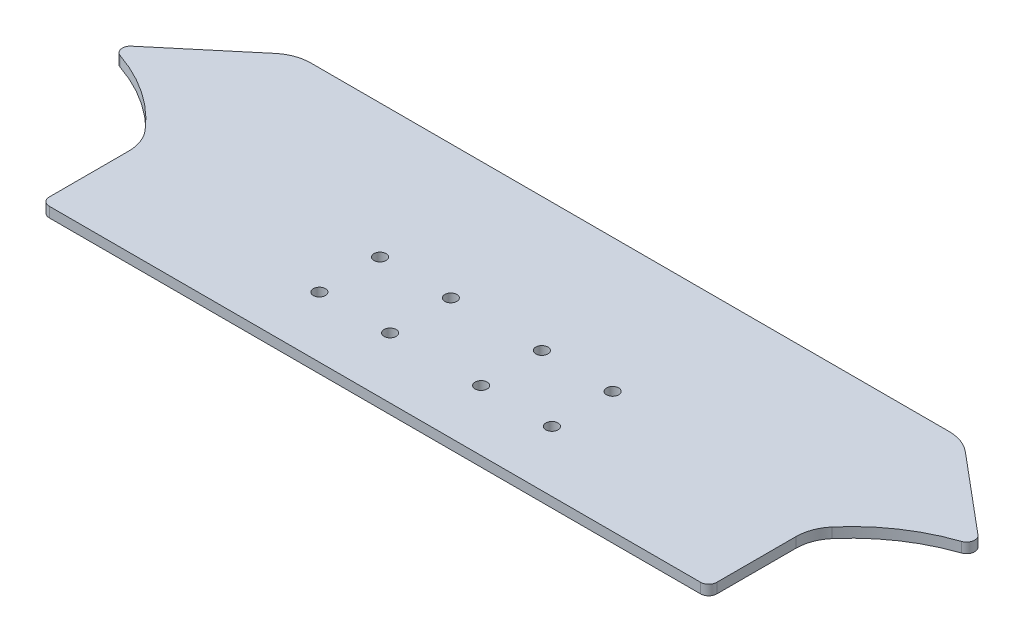
ISO-10303-21;
HEADER;
FILE_DESCRIPTION(('STEP AP214'),'2;1');
FILE_NAME('part.step','',(''),(''),'','','');
FILE_SCHEMA(('AUTOMOTIVE_DESIGN { 1 0 10303 214 1 1 1 1 }'));
ENDSEC;
DATA;
#1=APPLICATION_CONTEXT('core data for automotive mechanical design processes');
#2=APPLICATION_PROTOCOL_DEFINITION('international standard','automotive_design',2000,#1);
#3=PRODUCT_CONTEXT('',#1,'mechanical');
#4=PRODUCT('Part','Part','',(#3));
#5=PRODUCT_RELATED_PRODUCT_CATEGORY('part','',(#4));
#6=PRODUCT_DEFINITION_FORMATION('','',#4);
#7=PRODUCT_DEFINITION_CONTEXT('part definition',#1,'design');
#8=PRODUCT_DEFINITION('design','',#6,#7);
#9=PRODUCT_DEFINITION_SHAPE('','',#8);
#10=(LENGTH_UNIT() NAMED_UNIT(*) SI_UNIT(.MILLI.,.METRE.));
#11=(NAMED_UNIT(*) PLANE_ANGLE_UNIT() SI_UNIT($,.RADIAN.));
#12=(NAMED_UNIT(*) SI_UNIT($,.STERADIAN.) SOLID_ANGLE_UNIT());
#13=UNCERTAINTY_MEASURE_WITH_UNIT(LENGTH_MEASURE(1.E-05),#10,'distance_accuracy_value','');
#14=(GEOMETRIC_REPRESENTATION_CONTEXT(3) GLOBAL_UNCERTAINTY_ASSIGNED_CONTEXT((#13)) GLOBAL_UNIT_ASSIGNED_CONTEXT((#10,
#11,#12)) REPRESENTATION_CONTEXT('',''));
#15=CARTESIAN_POINT('',(0.,0.,0.));
#16=DIRECTION('',(0.,0.,1.));
#17=DIRECTION('',(1.,0.,0.));
#18=AXIS2_PLACEMENT_3D('',#15,#16,#17);
#19=CARTESIAN_POINT('',(-104.775,3.175,40.005));
#20=DIRECTION('',(1.,0.,0.));
#21=DIRECTION('',(0.,0.,-1.));
#22=AXIS2_PLACEMENT_3D('',#19,#20,#21);
#23=PLANE('',#22);
#24=DIRECTION('',(0.,0.,1.));
#25=VECTOR('',#24,1.);
#26=CARTESIAN_POINT('',(-104.775,0.,40.005));
#27=LINE('',#26,#25);
#28=CARTESIAN_POINT('',(-104.775,0.,12.591127239436));
#29=VERTEX_POINT('',#28);
#30=CARTESIAN_POINT('',(-104.775,0.,37.465));
#31=VERTEX_POINT('',#30);
#32=EDGE_CURVE('E264',#29,#31,#27,.T.);
#33=ORIENTED_EDGE('',*,*,#32,.T.);
#34=DIRECTION('',(0.,-1.,0.));
#35=VECTOR('',#34,1.);
#36=CARTESIAN_POINT('',(-104.775,3.175,37.465));
#37=LINE('',#36,#35);
#38=CARTESIAN_POINT('',(-104.775,3.175,37.465));
#39=VERTEX_POINT('',#38);
#40=EDGE_CURVE('E229',#31,#39,#37,.F.);
#41=ORIENTED_EDGE('',*,*,#40,.T.);
#42=DIRECTION('',(0.,0.,1.));
#43=VECTOR('',#42,1.);
#44=CARTESIAN_POINT('',(-104.775,3.175,40.005));
#45=LINE('',#44,#43);
#46=CARTESIAN_POINT('',(-104.775,3.175,12.591127239436));
#47=VERTEX_POINT('',#46);
#48=EDGE_CURVE('E183',#47,#39,#45,.T.);
#49=ORIENTED_EDGE('',*,*,#48,.F.);
#50=DIRECTION('',(0.,1.,0.));
#51=VECTOR('',#50,1.);
#52=CARTESIAN_POINT('',(-104.775,3.175,12.591127239436));
#53=LINE('',#52,#51);
#54=EDGE_CURVE('E170',#47,#29,#53,.F.);
#55=ORIENTED_EDGE('',*,*,#54,.T.);
#56=EDGE_LOOP('',(#33,#41,#49,#55));
#57=FACE_BOUND('',#56,.T.);
#58=ADVANCED_FACE('F36',(#57),#23,.F.);
#59=CARTESIAN_POINT('',(104.775,3.175,40.005));
#60=DIRECTION('',(-1.,0.,0.));
#61=DIRECTION('',(0.,0.,1.));
#62=AXIS2_PLACEMENT_3D('',#59,#60,#61);
#63=PLANE('',#62);
#64=DIRECTION('',(0.,0.,-1.));
#65=VECTOR('',#64,1.);
#66=CARTESIAN_POINT('',(104.775,3.175,40.005));
#67=LINE('',#66,#65);
#68=CARTESIAN_POINT('',(104.775,3.175,37.465));
#69=VERTEX_POINT('',#68);
#70=CARTESIAN_POINT('',(104.775,3.175,12.5911272394361));
#71=VERTEX_POINT('',#70);
#72=EDGE_CURVE('E273',#69,#71,#67,.T.);
#73=ORIENTED_EDGE('',*,*,#72,.F.);
#74=DIRECTION('',(0.,-1.,0.));
#75=VECTOR('',#74,1.);
#76=CARTESIAN_POINT('',(104.775,3.175,37.465));
#77=LINE('',#76,#75);
#78=CARTESIAN_POINT('',(104.775,0.,37.465));
#79=VERTEX_POINT('',#78);
#80=EDGE_CURVE('E231',#69,#79,#77,.T.);
#81=ORIENTED_EDGE('',*,*,#80,.T.);
#82=DIRECTION('',(0.,0.,-1.));
#83=VECTOR('',#82,1.);
#84=CARTESIAN_POINT('',(104.775,0.,40.005));
#85=LINE('',#84,#83);
#86=CARTESIAN_POINT('',(104.775,0.,12.5911272394361));
#87=VERTEX_POINT('',#86);
#88=EDGE_CURVE('E265',#79,#87,#85,.T.);
#89=ORIENTED_EDGE('',*,*,#88,.T.);
#90=DIRECTION('',(0.,1.,0.));
#91=VECTOR('',#90,1.);
#92=CARTESIAN_POINT('',(104.775,3.175,12.5911272394361));
#93=LINE('',#92,#91);
#94=EDGE_CURVE('E180',#87,#71,#93,.T.);
#95=ORIENTED_EDGE('',*,*,#94,.T.);
#96=EDGE_LOOP('',(#73,#81,#89,#95));
#97=FACE_BOUND('',#96,.T.);
#98=ADVANCED_FACE('F371',(#97),#63,.F.);
#99=CARTESIAN_POINT('',(-104.775,3.175,-40.005));
#100=DIRECTION('',(0.,0.,1.));
#101=DIRECTION('',(1.,0.,0.));
#102=AXIS2_PLACEMENT_3D('',#99,#100,#101);
#103=PLANE('',#102);
#104=DIRECTION('',(-1.,0.,0.));
#105=VECTOR('',#104,1.);
#106=CARTESIAN_POINT('',(-104.775,0.,-40.005));
#107=LINE('',#106,#105);
#108=CARTESIAN_POINT('',(100.152578024819,0.,-40.005));
#109=VERTEX_POINT('',#108);
#110=CARTESIAN_POINT('',(-100.152578024819,0.,-40.005));
#111=VERTEX_POINT('',#110);
#112=EDGE_CURVE('E261',#109,#111,#107,.T.);
#113=ORIENTED_EDGE('',*,*,#112,.T.);
#114=DIRECTION('',(0.,-1.,0.));
#115=VECTOR('',#114,1.);
#116=CARTESIAN_POINT('',(-100.152578024819,3.175,-40.005));
#117=LINE('',#116,#115);
#118=CARTESIAN_POINT('',(-100.152578024819,3.175,-40.005));
#119=VERTEX_POINT('',#118);
#120=EDGE_CURVE('E57',#111,#119,#117,.F.);
#121=ORIENTED_EDGE('',*,*,#120,.T.);
#122=DIRECTION('',(-1.,0.,0.));
#123=VECTOR('',#122,1.);
#124=CARTESIAN_POINT('',(-104.775,3.175,-40.005));
#125=LINE('',#124,#123);
#126=CARTESIAN_POINT('',(100.152578024819,3.175,-40.005));
#127=VERTEX_POINT('',#126);
#128=EDGE_CURVE('E248',#127,#119,#125,.T.);
#129=ORIENTED_EDGE('',*,*,#128,.F.);
#130=DIRECTION('',(0.,-1.,0.));
#131=VECTOR('',#130,1.);
#132=CARTESIAN_POINT('',(100.152578024819,0.,-40.005));
#133=LINE('',#132,#131);
#134=EDGE_CURVE('E241',#127,#109,#133,.T.);
#135=ORIENTED_EDGE('',*,*,#134,.T.);
#136=EDGE_LOOP('',(#113,#121,#129,#135));
#137=FACE_BOUND('',#136,.T.);
#138=ADVANCED_FACE('F262',(#137),#103,.F.);
#139=CARTESIAN_POINT('',(-104.775,3.175,40.005));
#140=DIRECTION('',(0.,0.,-1.));
#141=DIRECTION('',(-1.,0.,0.));
#142=AXIS2_PLACEMENT_3D('',#139,#140,#141);
#143=PLANE('',#142);
#144=DIRECTION('',(1.,0.,0.));
#145=VECTOR('',#144,1.);
#146=CARTESIAN_POINT('',(-104.775,3.175,40.005));
#147=LINE('',#146,#145);
#148=CARTESIAN_POINT('',(-102.235,3.175,40.005));
#149=VERTEX_POINT('',#148);
#150=CARTESIAN_POINT('',(102.235,3.175,40.005));
#151=VERTEX_POINT('',#150);
#152=EDGE_CURVE('E178',#149,#151,#147,.T.);
#153=ORIENTED_EDGE('',*,*,#152,.F.);
#154=DIRECTION('',(0.,-1.,0.));
#155=VECTOR('',#154,1.);
#156=CARTESIAN_POINT('',(-102.235,3.175,40.005));
#157=LINE('',#156,#155);
#158=CARTESIAN_POINT('',(-102.235,0.,40.005));
#159=VERTEX_POINT('',#158);
#160=EDGE_CURVE('E226',#149,#159,#157,.T.);
#161=ORIENTED_EDGE('',*,*,#160,.T.);
#162=DIRECTION('',(1.,0.,0.));
#163=VECTOR('',#162,1.);
#164=CARTESIAN_POINT('',(-104.775,0.,40.005));
#165=LINE('',#164,#163);
#166=CARTESIAN_POINT('',(102.235,0.,40.005));
#167=VERTEX_POINT('',#166);
#168=EDGE_CURVE('E186',#159,#167,#165,.T.);
#169=ORIENTED_EDGE('',*,*,#168,.T.);
#170=DIRECTION('',(0.,-1.,0.));
#171=VECTOR('',#170,1.);
#172=CARTESIAN_POINT('',(102.235,3.175,40.005));
#173=LINE('',#172,#171);
#174=EDGE_CURVE('E224',#167,#151,#173,.F.);
#175=ORIENTED_EDGE('',*,*,#174,.T.);
#176=EDGE_LOOP('',(#153,#161,#169,#175));
#177=FACE_BOUND('',#176,.T.);
#178=ADVANCED_FACE('F346',(#177),#143,.F.);
#179=CARTESIAN_POINT('',(0.,3.175,0.));
#180=DIRECTION('',(0.,-1.,0.));
#181=DIRECTION('',(0.,0.,-1.));
#182=AXIS2_PLACEMENT_3D('',#179,#180,#181);
#183=PLANE('',#182);
#184=CARTESIAN_POINT('',(36.5125,3.175,1.90499999999998));
#185=DIRECTION('',(0.,1.,0.));
#186=DIRECTION('',(0.,0.,1.));
#187=AXIS2_PLACEMENT_3D('',#184,#185,#186);
#188=CIRCLE('',#187,1.89865);
#189=CARTESIAN_POINT('',(36.5125,3.175,3.80364999999998));
#190=VERTEX_POINT('',#189);
#191=EDGE_CURVE('E304',#190,#190,#188,.T.);
#192=ORIENTED_EDGE('',*,*,#191,.F.);
#193=EDGE_LOOP('',(#192));
#194=FACE_BOUND('',#193,.T.);
#195=CARTESIAN_POINT('',(-36.5125,3.175,20.955));
#196=DIRECTION('',(0.,1.,0.));
#197=DIRECTION('',(0.,0.,1.));
#198=AXIS2_PLACEMENT_3D('',#195,#196,#197);
#199=CIRCLE('',#198,1.89865);
#200=CARTESIAN_POINT('',(-36.5125,3.175,22.85365));
#201=VERTEX_POINT('',#200);
#202=EDGE_CURVE('E311',#201,#201,#199,.T.);
#203=ORIENTED_EDGE('',*,*,#202,.F.);
#204=EDGE_LOOP('',(#203));
#205=FACE_BOUND('',#204,.T.);
#206=CARTESIAN_POINT('',(-14.2875,3.175,20.955));
#207=DIRECTION('',(0.,1.,0.));
#208=DIRECTION('',(0.,0.,1.));
#209=AXIS2_PLACEMENT_3D('',#206,#207,#208);
#210=CIRCLE('',#209,1.89865);
#211=CARTESIAN_POINT('',(-14.2875,3.175,22.85365));
#212=VERTEX_POINT('',#211);
#213=EDGE_CURVE('E292',#212,#212,#210,.T.);
#214=ORIENTED_EDGE('',*,*,#213,.F.);
#215=EDGE_LOOP('',(#214));
#216=FACE_BOUND('',#215,.T.);
#217=CARTESIAN_POINT('',(14.2875,3.175,20.955));
#218=DIRECTION('',(0.,1.,0.));
#219=DIRECTION('',(0.,0.,1.));
#220=AXIS2_PLACEMENT_3D('',#217,#218,#219);
#221=CIRCLE('',#220,1.89865);
#222=CARTESIAN_POINT('',(14.2875,3.175,22.85365));
#223=VERTEX_POINT('',#222);
#224=EDGE_CURVE('E299',#223,#223,#221,.T.);
#225=ORIENTED_EDGE('',*,*,#224,.F.);
#226=EDGE_LOOP('',(#225));
#227=FACE_BOUND('',#226,.T.);
#228=CARTESIAN_POINT('',(14.2875,3.175,1.90499999999999));
#229=DIRECTION('',(0.,1.,0.));
#230=DIRECTION('',(0.,0.,1.));
#231=AXIS2_PLACEMENT_3D('',#228,#229,#230);
#232=CIRCLE('',#231,1.89865);
#233=CARTESIAN_POINT('',(14.2875,3.175,3.80364999999999));
#234=VERTEX_POINT('',#233);
#235=EDGE_CURVE('E328',#234,#234,#232,.T.);
#236=ORIENTED_EDGE('',*,*,#235,.F.);
#237=EDGE_LOOP('',(#236));
#238=FACE_BOUND('',#237,.T.);
#239=CARTESIAN_POINT('',(-14.2875,3.175,1.90499999999999));
#240=DIRECTION('',(0.,1.,0.));
#241=DIRECTION('',(0.,0.,1.));
#242=AXIS2_PLACEMENT_3D('',#239,#240,#241);
#243=CIRCLE('',#242,1.89865);
#244=CARTESIAN_POINT('',(-14.2875,3.175,3.80364999999999));
#245=VERTEX_POINT('',#244);
#246=EDGE_CURVE('E322',#245,#245,#243,.T.);
#247=ORIENTED_EDGE('',*,*,#246,.F.);
#248=EDGE_LOOP('',(#247));
#249=FACE_BOUND('',#248,.T.);
#250=CARTESIAN_POINT('',(-36.5125,3.175,1.90499999999999));
#251=DIRECTION('',(0.,1.,0.));
#252=DIRECTION('',(0.,0.,1.));
#253=AXIS2_PLACEMENT_3D('',#250,#251,#252);
#254=CIRCLE('',#253,1.89865);
#255=CARTESIAN_POINT('',(-36.5125,3.175,3.80364999999999));
#256=VERTEX_POINT('',#255);
#257=EDGE_CURVE('E316',#256,#256,#254,.T.);
#258=ORIENTED_EDGE('',*,*,#257,.F.);
#259=EDGE_LOOP('',(#258));
#260=FACE_BOUND('',#259,.T.);
#261=CARTESIAN_POINT('',(36.5125,3.175,20.955));
#262=DIRECTION('',(0.,1.,0.));
#263=DIRECTION('',(0.,0.,1.));
#264=AXIS2_PLACEMENT_3D('',#261,#262,#263);
#265=CIRCLE('',#264,1.89865);
#266=CARTESIAN_POINT('',(36.5125,3.175,22.85365));
#267=VERTEX_POINT('',#266);
#268=EDGE_CURVE('E286',#267,#267,#265,.T.);
#269=ORIENTED_EDGE('',*,*,#268,.F.);
#270=EDGE_LOOP('',(#269));
#271=FACE_BOUND('',#270,.T.);
#272=ORIENTED_EDGE('',*,*,#128,.T.);
#273=CARTESIAN_POINT('',(-100.152578024819,3.175,-27.305));
#274=DIRECTION('',(0.,-1.,0.));
#275=DIRECTION('',(0.,0.,-1.));
#276=AXIS2_PLACEMENT_3D('',#273,#274,#275);
#277=CIRCLE('',#276,12.7);
#278=CARTESIAN_POINT('',(-108.315980667838,3.175,-37.0337644276111));
#279=VERTEX_POINT('',#278);
#280=EDGE_CURVE('E44',#119,#279,#277,.F.);
#281=ORIENTED_EDGE('',*,*,#280,.T.);
#282=DIRECTION('',(-0.766044443118982,0.,0.642787609686535));
#283=VECTOR('',#282,1.);
#284=CARTESIAN_POINT('',(-104.775,3.175,-40.005));
#285=LINE('',#284,#283);
#286=CARTESIAN_POINT('',(-132.884389834064,3.175,-16.4184213576186));
#287=VERTEX_POINT('',#286);
#288=EDGE_CURVE('E162',#279,#287,#285,.T.);
#289=ORIENTED_EDGE('',*,*,#288,.T.);
#290=CARTESIAN_POINT('',(-131.25170930546,3.175,-14.4726684720964));
#291=DIRECTION('',(0.,-1.,0.));
#292=DIRECTION('',(0.,0.,-1.));
#293=AXIS2_PLACEMENT_3D('',#290,#291,#292);
#294=CIRCLE('',#293,2.54);
#295=CARTESIAN_POINT('',(-132.063578843598,3.175,-12.0659138412618));
#296=VERTEX_POINT('',#295);
#297=EDGE_CURVE('E157',#287,#296,#294,.F.);
#298=ORIENTED_EDGE('',*,*,#297,.T.);
#299=CARTESIAN_POINT('',(-149.628638542296,3.175,40.005));
#300=DIRECTION('',(0.,-1.,0.));
#301=DIRECTION('',(0.,0.,1.));
#302=AXIS2_PLACEMENT_3D('',#299,#300,#301);
#303=CIRCLE('',#302,54.9537204425953);
#304=CARTESIAN_POINT('',(-107.810733629849,3.175,4.35146975099881));
#305=VERTEX_POINT('',#304);
#306=EDGE_CURVE('E150',#296,#305,#303,.T.);
#307=ORIENTED_EDGE('',*,*,#306,.T.);
#308=CARTESIAN_POINT('',(-117.475,3.175,12.591127239436));
#309=DIRECTION('',(0.,-1.,0.));
#310=DIRECTION('',(0.,0.,-1.));
#311=AXIS2_PLACEMENT_3D('',#308,#309,#310);
#312=CIRCLE('',#311,12.7);
#313=EDGE_CURVE('E154',#305,#47,#312,.T.);
#314=ORIENTED_EDGE('',*,*,#313,.T.);
#315=ORIENTED_EDGE('',*,*,#48,.T.);
#316=CARTESIAN_POINT('',(-102.235,3.175,37.465));
#317=DIRECTION('',(0.,-1.,0.));
#318=DIRECTION('',(0.,0.,-1.));
#319=AXIS2_PLACEMENT_3D('',#316,#317,#318);
#320=CIRCLE('',#319,2.54);
#321=EDGE_CURVE('E203',#39,#149,#320,.F.);
#322=ORIENTED_EDGE('',*,*,#321,.T.);
#323=ORIENTED_EDGE('',*,*,#152,.T.);
#324=CARTESIAN_POINT('',(102.235,3.175,37.465));
#325=DIRECTION('',(0.,-1.,0.));
#326=DIRECTION('',(0.,0.,-1.));
#327=AXIS2_PLACEMENT_3D('',#324,#325,#326);
#328=CIRCLE('',#327,2.54);
#329=EDGE_CURVE('E201',#151,#69,#328,.F.);
#330=ORIENTED_EDGE('',*,*,#329,.T.);
#331=ORIENTED_EDGE('',*,*,#72,.T.);
#332=CARTESIAN_POINT('',(117.475,3.175,12.5911272394361));
#333=DIRECTION('',(0.,-1.,0.));
#334=DIRECTION('',(0.,0.,-1.));
#335=AXIS2_PLACEMENT_3D('',#332,#333,#334);
#336=CIRCLE('',#335,12.7);
#337=CARTESIAN_POINT('',(107.810733629849,3.175,4.35146975099884));
#338=VERTEX_POINT('',#337);
#339=EDGE_CURVE('E193',#71,#338,#336,.T.);
#340=ORIENTED_EDGE('',*,*,#339,.T.);
#341=CARTESIAN_POINT('',(149.628638542296,3.175,40.005));
#342=DIRECTION('',(0.,-1.,0.));
#343=DIRECTION('',(0.,0.,1.));
#344=AXIS2_PLACEMENT_3D('',#341,#342,#343);
#345=CIRCLE('',#344,54.9537204425952);
#346=CARTESIAN_POINT('',(132.063578843598,3.175,-12.0659138412618));
#347=VERTEX_POINT('',#346);
#348=EDGE_CURVE('E278',#338,#347,#345,.T.);
#349=ORIENTED_EDGE('',*,*,#348,.T.);
#350=CARTESIAN_POINT('',(131.25170930546,3.175,-14.4726684720964));
#351=DIRECTION('',(0.,-1.,0.));
#352=DIRECTION('',(0.,0.,-1.));
#353=AXIS2_PLACEMENT_3D('',#350,#351,#352);
#354=CIRCLE('',#353,2.54);
#355=CARTESIAN_POINT('',(132.884389834064,3.175,-16.4184213576186));
#356=VERTEX_POINT('',#355);
#357=EDGE_CURVE('E205',#347,#356,#354,.F.);
#358=ORIENTED_EDGE('',*,*,#357,.T.);
#359=DIRECTION('',(-0.766044443118982,0.,-0.642787609686535));
#360=VECTOR('',#359,1.);
#361=CARTESIAN_POINT('',(104.775,3.175,-40.005));
#362=LINE('',#361,#360);
#363=CARTESIAN_POINT('',(108.315980667838,3.175,-37.0337644276111));
#364=VERTEX_POINT('',#363);
#365=EDGE_CURVE('E275',#356,#364,#362,.T.);
#366=ORIENTED_EDGE('',*,*,#365,.T.);
#367=CARTESIAN_POINT('',(100.152578024819,3.175,-27.305));
#368=DIRECTION('',(0.,-1.,0.));
#369=DIRECTION('',(0.,0.,-1.));
#370=AXIS2_PLACEMENT_3D('',#367,#368,#369);
#371=CIRCLE('',#370,12.7);
#372=EDGE_CURVE('E245',#364,#127,#371,.F.);
#373=ORIENTED_EDGE('',*,*,#372,.T.);
#374=EDGE_LOOP('',(#272,#281,#289,#298,#307,#314,#315,#322,#323,#330,#331,#340,#349,#358,#366,#373));
#375=FACE_BOUND('',#374,.T.);
#376=ADVANCED_FACE('F152',(#194,#205,#216,#227,#238,#249,#260,#271,#375),#183,.F.);
#377=CARTESIAN_POINT('',(0.,0.,0.));
#378=DIRECTION('',(0.,-1.,0.));
#379=DIRECTION('',(0.,0.,-1.));
#380=AXIS2_PLACEMENT_3D('',#377,#378,#379);
#381=PLANE('',#380);
#382=CARTESIAN_POINT('',(36.5125,0.,1.90499999999998));
#383=DIRECTION('',(0.,1.,0.));
#384=DIRECTION('',(0.,0.,1.));
#385=AXIS2_PLACEMENT_3D('',#382,#383,#384);
#386=CIRCLE('',#385,1.89865);
#387=CARTESIAN_POINT('',(36.5125,0.,3.80364999999998));
#388=VERTEX_POINT('',#387);
#389=EDGE_CURVE('E307',#388,#388,#386,.T.);
#390=ORIENTED_EDGE('',*,*,#389,.T.);
#391=EDGE_LOOP('',(#390));
#392=FACE_BOUND('',#391,.T.);
#393=CARTESIAN_POINT('',(-36.5125,0.,20.955));
#394=DIRECTION('',(0.,1.,0.));
#395=DIRECTION('',(0.,0.,1.));
#396=AXIS2_PLACEMENT_3D('',#393,#394,#395);
#397=CIRCLE('',#396,1.89865);
#398=CARTESIAN_POINT('',(-36.5125,0.,22.85365));
#399=VERTEX_POINT('',#398);
#400=EDGE_CURVE('E296',#399,#399,#397,.T.);
#401=ORIENTED_EDGE('',*,*,#400,.T.);
#402=EDGE_LOOP('',(#401));
#403=FACE_BOUND('',#402,.T.);
#404=CARTESIAN_POINT('',(-14.2875,0.,20.955));
#405=DIRECTION('',(0.,1.,0.));
#406=DIRECTION('',(0.,0.,1.));
#407=AXIS2_PLACEMENT_3D('',#404,#405,#406);
#408=CIRCLE('',#407,1.89865);
#409=CARTESIAN_POINT('',(-14.2875,0.,22.85365));
#410=VERTEX_POINT('',#409);
#411=EDGE_CURVE('E295',#410,#410,#408,.T.);
#412=ORIENTED_EDGE('',*,*,#411,.T.);
#413=EDGE_LOOP('',(#412));
#414=FACE_BOUND('',#413,.T.);
#415=CARTESIAN_POINT('',(14.2875,0.,20.955));
#416=DIRECTION('',(0.,1.,0.));
#417=DIRECTION('',(0.,0.,1.));
#418=AXIS2_PLACEMENT_3D('',#415,#416,#417);
#419=CIRCLE('',#418,1.89865);
#420=CARTESIAN_POINT('',(14.2875,0.,22.85365));
#421=VERTEX_POINT('',#420);
#422=EDGE_CURVE('E289',#421,#421,#419,.T.);
#423=ORIENTED_EDGE('',*,*,#422,.T.);
#424=EDGE_LOOP('',(#423));
#425=FACE_BOUND('',#424,.T.);
#426=CARTESIAN_POINT('',(14.2875,0.,1.90499999999999));
#427=DIRECTION('',(0.,1.,0.));
#428=DIRECTION('',(0.,0.,1.));
#429=AXIS2_PLACEMENT_3D('',#426,#427,#428);
#430=CIRCLE('',#429,1.89865);
#431=CARTESIAN_POINT('',(14.2875,0.,3.80364999999999));
#432=VERTEX_POINT('',#431);
#433=EDGE_CURVE('E308',#432,#432,#430,.T.);
#434=ORIENTED_EDGE('',*,*,#433,.T.);
#435=EDGE_LOOP('',(#434));
#436=FACE_BOUND('',#435,.T.);
#437=CARTESIAN_POINT('',(-14.2875,0.,1.90499999999999));
#438=DIRECTION('',(0.,1.,0.));
#439=DIRECTION('',(0.,0.,1.));
#440=AXIS2_PLACEMENT_3D('',#437,#438,#439);
#441=CIRCLE('',#440,1.89865);
#442=CARTESIAN_POINT('',(-14.2875,0.,3.80364999999999));
#443=VERTEX_POINT('',#442);
#444=EDGE_CURVE('E325',#443,#443,#441,.T.);
#445=ORIENTED_EDGE('',*,*,#444,.T.);
#446=EDGE_LOOP('',(#445));
#447=FACE_BOUND('',#446,.T.);
#448=CARTESIAN_POINT('',(-36.5125,0.,1.90499999999999));
#449=DIRECTION('',(0.,1.,0.));
#450=DIRECTION('',(0.,0.,1.));
#451=AXIS2_PLACEMENT_3D('',#448,#449,#450);
#452=CIRCLE('',#451,1.89865);
#453=CARTESIAN_POINT('',(-36.5125,0.,3.80364999999999));
#454=VERTEX_POINT('',#453);
#455=EDGE_CURVE('E319',#454,#454,#452,.T.);
#456=ORIENTED_EDGE('',*,*,#455,.T.);
#457=EDGE_LOOP('',(#456));
#458=FACE_BOUND('',#457,.T.);
#459=CARTESIAN_POINT('',(36.5125,0.,20.955));
#460=DIRECTION('',(0.,1.,0.));
#461=DIRECTION('',(0.,0.,1.));
#462=AXIS2_PLACEMENT_3D('',#459,#460,#461);
#463=CIRCLE('',#462,1.89865);
#464=CARTESIAN_POINT('',(36.5125,0.,22.85365));
#465=VERTEX_POINT('',#464);
#466=EDGE_CURVE('E255',#465,#465,#463,.T.);
#467=ORIENTED_EDGE('',*,*,#466,.T.);
#468=EDGE_LOOP('',(#467));
#469=FACE_BOUND('',#468,.T.);
#470=DIRECTION('',(-0.766044443118982,0.,0.642787609686535));
#471=VECTOR('',#470,1.);
#472=CARTESIAN_POINT('',(-104.775,0.,-40.005));
#473=LINE('',#472,#471);
#474=CARTESIAN_POINT('',(-108.315980667838,0.,-37.0337644276111));
#475=VERTEX_POINT('',#474);
#476=CARTESIAN_POINT('',(-132.884389834064,0.,-16.4184213576186));
#477=VERTEX_POINT('',#476);
#478=EDGE_CURVE('E161',#475,#477,#473,.T.);
#479=ORIENTED_EDGE('',*,*,#478,.F.);
#480=CARTESIAN_POINT('',(-100.152578024819,0.,-27.305));
#481=DIRECTION('',(0.,-1.,0.));
#482=DIRECTION('',(0.,0.,-1.));
#483=AXIS2_PLACEMENT_3D('',#480,#481,#482);
#484=CIRCLE('',#483,12.7);
#485=EDGE_CURVE('E239',#475,#111,#484,.T.);
#486=ORIENTED_EDGE('',*,*,#485,.T.);
#487=ORIENTED_EDGE('',*,*,#112,.F.);
#488=CARTESIAN_POINT('',(100.152578024819,0.,-27.305));
#489=DIRECTION('',(0.,-1.,0.));
#490=DIRECTION('',(0.,0.,-1.));
#491=AXIS2_PLACEMENT_3D('',#488,#489,#490);
#492=CIRCLE('',#491,12.7);
#493=CARTESIAN_POINT('',(108.315980667838,0.,-37.0337644276111));
#494=VERTEX_POINT('',#493);
#495=EDGE_CURVE('E237',#109,#494,#492,.T.);
#496=ORIENTED_EDGE('',*,*,#495,.T.);
#497=DIRECTION('',(-0.766044443118982,0.,-0.642787609686535));
#498=VECTOR('',#497,1.);
#499=CARTESIAN_POINT('',(104.775,0.,-40.005));
#500=LINE('',#499,#498);
#501=CARTESIAN_POINT('',(132.884389834064,0.,-16.4184213576186));
#502=VERTEX_POINT('',#501);
#503=EDGE_CURVE('E268',#502,#494,#500,.T.);
#504=ORIENTED_EDGE('',*,*,#503,.F.);
#505=CARTESIAN_POINT('',(131.25170930546,0.,-14.4726684720964));
#506=DIRECTION('',(0.,-1.,0.));
#507=DIRECTION('',(0.,0.,-1.));
#508=AXIS2_PLACEMENT_3D('',#505,#506,#507);
#509=CIRCLE('',#508,2.54);
#510=CARTESIAN_POINT('',(132.063578843598,0.,-12.0659138412618));
#511=VERTEX_POINT('',#510);
#512=EDGE_CURVE('E214',#502,#511,#509,.T.);
#513=ORIENTED_EDGE('',*,*,#512,.T.);
#514=CARTESIAN_POINT('',(149.628638542296,0.,40.005));
#515=DIRECTION('',(0.,-1.,0.));
#516=DIRECTION('',(0.,0.,1.));
#517=AXIS2_PLACEMENT_3D('',#514,#515,#516);
#518=CIRCLE('',#517,54.9537204425952);
#519=CARTESIAN_POINT('',(107.810733629849,0.,4.35146975099884));
#520=VERTEX_POINT('',#519);
#521=EDGE_CURVE('E277',#520,#511,#518,.T.);
#522=ORIENTED_EDGE('',*,*,#521,.F.);
#523=CARTESIAN_POINT('',(117.475,0.,12.5911272394361));
#524=DIRECTION('',(0.,-1.,0.));
#525=DIRECTION('',(0.,0.,-1.));
#526=AXIS2_PLACEMENT_3D('',#523,#524,#525);
#527=CIRCLE('',#526,12.7);
#528=EDGE_CURVE('E195',#520,#87,#527,.F.);
#529=ORIENTED_EDGE('',*,*,#528,.T.);
#530=ORIENTED_EDGE('',*,*,#88,.F.);
#531=CARTESIAN_POINT('',(102.235,0.,37.465));
#532=DIRECTION('',(0.,-1.,0.));
#533=DIRECTION('',(0.,0.,-1.));
#534=AXIS2_PLACEMENT_3D('',#531,#532,#533);
#535=CIRCLE('',#534,2.54);
#536=EDGE_CURVE('E210',#79,#167,#535,.T.);
#537=ORIENTED_EDGE('',*,*,#536,.T.);
#538=ORIENTED_EDGE('',*,*,#168,.F.);
#539=CARTESIAN_POINT('',(-102.235,0.,37.465));
#540=DIRECTION('',(0.,-1.,0.));
#541=DIRECTION('',(0.,0.,-1.));
#542=AXIS2_PLACEMENT_3D('',#539,#540,#541);
#543=CIRCLE('',#542,2.54);
#544=EDGE_CURVE('E212',#159,#31,#543,.T.);
#545=ORIENTED_EDGE('',*,*,#544,.T.);
#546=ORIENTED_EDGE('',*,*,#32,.F.);
#547=CARTESIAN_POINT('',(-117.475,0.,12.591127239436));
#548=DIRECTION('',(0.,-1.,0.));
#549=DIRECTION('',(0.,0.,-1.));
#550=AXIS2_PLACEMENT_3D('',#547,#548,#549);
#551=CIRCLE('',#550,12.7);
#552=CARTESIAN_POINT('',(-107.810733629849,0.,4.35146975099881));
#553=VERTEX_POINT('',#552);
#554=EDGE_CURVE('E171',#29,#553,#551,.F.);
#555=ORIENTED_EDGE('',*,*,#554,.T.);
#556=CARTESIAN_POINT('',(-149.628638542296,0.,40.005));
#557=DIRECTION('',(0.,-1.,0.));
#558=DIRECTION('',(0.,0.,1.));
#559=AXIS2_PLACEMENT_3D('',#556,#557,#558);
#560=CIRCLE('',#559,54.9537204425953);
#561=CARTESIAN_POINT('',(-132.063578843598,0.,-12.0659138412618));
#562=VERTEX_POINT('',#561);
#563=EDGE_CURVE('E176',#562,#553,#560,.T.);
#564=ORIENTED_EDGE('',*,*,#563,.F.);
#565=CARTESIAN_POINT('',(-131.25170930546,0.,-14.4726684720964));
#566=DIRECTION('',(0.,-1.,0.));
#567=DIRECTION('',(0.,0.,-1.));
#568=AXIS2_PLACEMENT_3D('',#565,#566,#567);
#569=CIRCLE('',#568,2.54);
#570=EDGE_CURVE('E216',#562,#477,#569,.T.);
#571=ORIENTED_EDGE('',*,*,#570,.T.);
#572=EDGE_LOOP('',(#479,#486,#487,#496,#504,#513,#522,#529,#530,#537,#538,#545,#546,#555,#564,#571));
#573=FACE_BOUND('',#572,.T.);
#574=ADVANCED_FACE('F260',(#392,#403,#414,#425,#436,#447,#458,#469,#573),#381,.T.);
#575=CARTESIAN_POINT('',(104.775,0.,-40.005));
#576=DIRECTION('',(0.642787609686535,0.,-0.766044443118982));
#577=DIRECTION('',(-0.766044443118982,0.,-0.642787609686535));
#578=AXIS2_PLACEMENT_3D('',#575,#576,#577);
#579=PLANE('',#578);
#580=ORIENTED_EDGE('',*,*,#503,.T.);
#581=DIRECTION('',(0.,-1.,0.));
#582=VECTOR('',#581,1.);
#583=CARTESIAN_POINT('',(108.315980667838,3.175,-37.0337644276111));
#584=LINE('',#583,#582);
#585=EDGE_CURVE('E11',#494,#364,#584,.F.);
#586=ORIENTED_EDGE('',*,*,#585,.T.);
#587=ORIENTED_EDGE('',*,*,#365,.F.);
#588=DIRECTION('',(0.,1.,0.));
#589=VECTOR('',#588,1.);
#590=CARTESIAN_POINT('',(132.884389834064,0.,-16.4184213576186));
#591=LINE('',#590,#589);
#592=EDGE_CURVE('E222',#356,#502,#591,.F.);
#593=ORIENTED_EDGE('',*,*,#592,.T.);
#594=EDGE_LOOP('',(#580,#586,#587,#593));
#595=FACE_BOUND('',#594,.T.);
#596=ADVANCED_FACE('F415',(#595),#579,.T.);
#597=CARTESIAN_POINT('',(149.628638542296,0.,40.005));
#598=DIRECTION('',(0.,1.,0.));
#599=DIRECTION('',(0.,0.,1.));
#600=AXIS2_PLACEMENT_3D('',#597,#598,#599);
#601=CYLINDRICAL_SURFACE('',#600,54.9537204425952);
#602=ORIENTED_EDGE('',*,*,#521,.T.);
#603=DIRECTION('',(0.,1.,0.));
#604=VECTOR('',#603,1.);
#605=CARTESIAN_POINT('',(132.063578843598,0.,-12.0659138412618));
#606=LINE('',#605,#604);
#607=EDGE_CURVE('E219',#511,#347,#606,.T.);
#608=ORIENTED_EDGE('',*,*,#607,.T.);
#609=ORIENTED_EDGE('',*,*,#348,.F.);
#610=DIRECTION('',(0.,1.,0.));
#611=VECTOR('',#610,1.);
#612=CARTESIAN_POINT('',(107.810733629849,0.,4.35146975099884));
#613=LINE('',#612,#611);
#614=EDGE_CURVE('E172',#338,#520,#613,.F.);
#615=ORIENTED_EDGE('',*,*,#614,.T.);
#616=EDGE_LOOP('',(#602,#608,#609,#615));
#617=FACE_BOUND('',#616,.T.);
#618=ADVANCED_FACE('F422',(#617),#601,.F.);
#619=CARTESIAN_POINT('',(-149.628638542296,0.,40.005));
#620=DIRECTION('',(0.,1.,0.));
#621=DIRECTION('',(0.,0.,1.));
#622=AXIS2_PLACEMENT_3D('',#619,#620,#621);
#623=CYLINDRICAL_SURFACE('',#622,54.9537204425953);
#624=ORIENTED_EDGE('',*,*,#306,.F.);
#625=DIRECTION('',(0.,1.,0.));
#626=VECTOR('',#625,1.);
#627=CARTESIAN_POINT('',(-132.063578843598,0.,-12.0659138412618));
#628=LINE('',#627,#626);
#629=EDGE_CURVE('E208',#296,#562,#628,.F.);
#630=ORIENTED_EDGE('',*,*,#629,.T.);
#631=ORIENTED_EDGE('',*,*,#563,.T.);
#632=DIRECTION('',(0.,1.,0.));
#633=VECTOR('',#632,1.);
#634=CARTESIAN_POINT('',(-107.810733629849,0.,4.35146975099881));
#635=LINE('',#634,#633);
#636=EDGE_CURVE('E169',#553,#305,#635,.T.);
#637=ORIENTED_EDGE('',*,*,#636,.T.);
#638=EDGE_LOOP('',(#624,#630,#631,#637));
#639=FACE_BOUND('',#638,.T.);
#640=ADVANCED_FACE('F174',(#639),#623,.F.);
#641=CARTESIAN_POINT('',(-104.775,0.,-40.005));
#642=DIRECTION('',(-0.642787609686535,0.,-0.766044443118982));
#643=DIRECTION('',(-0.766044443118982,0.,0.642787609686535));
#644=AXIS2_PLACEMENT_3D('',#641,#642,#643);
#645=PLANE('',#644);
#646=ORIENTED_EDGE('',*,*,#288,.F.);
#647=DIRECTION('',(0.,-1.,0.));
#648=VECTOR('',#647,1.);
#649=CARTESIAN_POINT('',(-108.315980667838,0.,-37.0337644276111));
#650=LINE('',#649,#648);
#651=EDGE_CURVE('E234',#279,#475,#650,.T.);
#652=ORIENTED_EDGE('',*,*,#651,.T.);
#653=ORIENTED_EDGE('',*,*,#478,.T.);
#654=DIRECTION('',(0.,1.,0.));
#655=VECTOR('',#654,1.);
#656=CARTESIAN_POINT('',(-132.884389834064,0.,-16.4184213576186));
#657=LINE('',#656,#655);
#658=EDGE_CURVE('E198',#477,#287,#657,.T.);
#659=ORIENTED_EDGE('',*,*,#658,.T.);
#660=EDGE_LOOP('',(#646,#652,#653,#659));
#661=FACE_BOUND('',#660,.T.);
#662=ADVANCED_FACE('F252',(#661),#645,.T.);
#663=CARTESIAN_POINT('',(36.5125,0.,20.955));
#664=DIRECTION('',(0.,1.,0.));
#665=DIRECTION('',(0.,0.,1.));
#666=AXIS2_PLACEMENT_3D('',#663,#664,#665);
#667=CYLINDRICAL_SURFACE('',#666,1.89865);
#668=ORIENTED_EDGE('',*,*,#466,.F.);
#669=EDGE_LOOP('',(#668));
#670=FACE_BOUND('',#669,.T.);
#671=ORIENTED_EDGE('',*,*,#268,.T.);
#672=EDGE_LOOP('',(#671));
#673=FACE_BOUND('',#672,.T.);
#674=ADVANCED_FACE('F355',(#670,#673),#667,.F.);
#675=CARTESIAN_POINT('',(-36.5125,0.,1.90499999999999));
#676=DIRECTION('',(0.,1.,0.));
#677=DIRECTION('',(0.,0.,1.));
#678=AXIS2_PLACEMENT_3D('',#675,#676,#677);
#679=CYLINDRICAL_SURFACE('',#678,1.89865);
#680=ORIENTED_EDGE('',*,*,#455,.F.);
#681=EDGE_LOOP('',(#680));
#682=FACE_BOUND('',#681,.T.);
#683=ORIENTED_EDGE('',*,*,#257,.T.);
#684=EDGE_LOOP('',(#683));
#685=FACE_BOUND('',#684,.T.);
#686=ADVANCED_FACE('F357',(#682,#685),#679,.F.);
#687=CARTESIAN_POINT('',(-14.2875,0.,1.90499999999999));
#688=DIRECTION('',(0.,1.,0.));
#689=DIRECTION('',(0.,0.,1.));
#690=AXIS2_PLACEMENT_3D('',#687,#688,#689);
#691=CYLINDRICAL_SURFACE('',#690,1.89865);
#692=ORIENTED_EDGE('',*,*,#444,.F.);
#693=EDGE_LOOP('',(#692));
#694=FACE_BOUND('',#693,.T.);
#695=ORIENTED_EDGE('',*,*,#246,.T.);
#696=EDGE_LOOP('',(#695));
#697=FACE_BOUND('',#696,.T.);
#698=ADVANCED_FACE('F340',(#694,#697),#691,.F.);
#699=CARTESIAN_POINT('',(14.2875,0.,1.90499999999999));
#700=DIRECTION('',(0.,1.,0.));
#701=DIRECTION('',(0.,0.,1.));
#702=AXIS2_PLACEMENT_3D('',#699,#700,#701);
#703=CYLINDRICAL_SURFACE('',#702,1.89865);
#704=ORIENTED_EDGE('',*,*,#433,.F.);
#705=EDGE_LOOP('',(#704));
#706=FACE_BOUND('',#705,.T.);
#707=ORIENTED_EDGE('',*,*,#235,.T.);
#708=EDGE_LOOP('',(#707));
#709=FACE_BOUND('',#708,.T.);
#710=ADVANCED_FACE('F336',(#706,#709),#703,.F.);
#711=CARTESIAN_POINT('',(14.2875,0.,20.955));
#712=DIRECTION('',(0.,1.,0.));
#713=DIRECTION('',(0.,0.,1.));
#714=AXIS2_PLACEMENT_3D('',#711,#712,#713);
#715=CYLINDRICAL_SURFACE('',#714,1.89865);
#716=ORIENTED_EDGE('',*,*,#422,.F.);
#717=EDGE_LOOP('',(#716));
#718=FACE_BOUND('',#717,.T.);
#719=ORIENTED_EDGE('',*,*,#224,.T.);
#720=EDGE_LOOP('',(#719));
#721=FACE_BOUND('',#720,.T.);
#722=ADVANCED_FACE('F339',(#718,#721),#715,.F.);
#723=CARTESIAN_POINT('',(-14.2875,0.,20.955));
#724=DIRECTION('',(0.,1.,0.));
#725=DIRECTION('',(0.,0.,1.));
#726=AXIS2_PLACEMENT_3D('',#723,#724,#725);
#727=CYLINDRICAL_SURFACE('',#726,1.89865);
#728=ORIENTED_EDGE('',*,*,#411,.F.);
#729=EDGE_LOOP('',(#728));
#730=FACE_BOUND('',#729,.T.);
#731=ORIENTED_EDGE('',*,*,#213,.T.);
#732=EDGE_LOOP('',(#731));
#733=FACE_BOUND('',#732,.T.);
#734=ADVANCED_FACE('F536',(#730,#733),#727,.F.);
#735=CARTESIAN_POINT('',(-36.5125,0.,20.955));
#736=DIRECTION('',(0.,1.,0.));
#737=DIRECTION('',(0.,0.,1.));
#738=AXIS2_PLACEMENT_3D('',#735,#736,#737);
#739=CYLINDRICAL_SURFACE('',#738,1.89865);
#740=ORIENTED_EDGE('',*,*,#400,.F.);
#741=EDGE_LOOP('',(#740));
#742=FACE_BOUND('',#741,.T.);
#743=ORIENTED_EDGE('',*,*,#202,.T.);
#744=EDGE_LOOP('',(#743));
#745=FACE_BOUND('',#744,.T.);
#746=ADVANCED_FACE('F527',(#742,#745),#739,.F.);
#747=CARTESIAN_POINT('',(36.5125,0.,1.90499999999998));
#748=DIRECTION('',(0.,1.,0.));
#749=DIRECTION('',(0.,0.,1.));
#750=AXIS2_PLACEMENT_3D('',#747,#748,#749);
#751=CYLINDRICAL_SURFACE('',#750,1.89865);
#752=ORIENTED_EDGE('',*,*,#389,.F.);
#753=EDGE_LOOP('',(#752));
#754=FACE_BOUND('',#753,.T.);
#755=ORIENTED_EDGE('',*,*,#191,.T.);
#756=EDGE_LOOP('',(#755));
#757=FACE_BOUND('',#756,.T.);
#758=ADVANCED_FACE('F387',(#754,#757),#751,.F.);
#759=CARTESIAN_POINT('',(-117.475,0.,12.591127239436));
#760=DIRECTION('',(0.,1.,0.));
#761=DIRECTION('',(0.,0.,1.));
#762=AXIS2_PLACEMENT_3D('',#759,#760,#761);
#763=CYLINDRICAL_SURFACE('',#762,12.7);
#764=ORIENTED_EDGE('',*,*,#554,.F.);
#765=ORIENTED_EDGE('',*,*,#54,.F.);
#766=ORIENTED_EDGE('',*,*,#313,.F.);
#767=ORIENTED_EDGE('',*,*,#636,.F.);
#768=EDGE_LOOP('',(#764,#765,#766,#767));
#769=FACE_BOUND('',#768,.T.);
#770=ADVANCED_FACE('F168',(#769),#763,.F.);
#771=CARTESIAN_POINT('',(117.475,0.,12.5911272394361));
#772=DIRECTION('',(0.,1.,0.));
#773=DIRECTION('',(0.,0.,1.));
#774=AXIS2_PLACEMENT_3D('',#771,#772,#773);
#775=CYLINDRICAL_SURFACE('',#774,12.7);
#776=ORIENTED_EDGE('',*,*,#528,.F.);
#777=ORIENTED_EDGE('',*,*,#614,.F.);
#778=ORIENTED_EDGE('',*,*,#339,.F.);
#779=ORIENTED_EDGE('',*,*,#94,.F.);
#780=EDGE_LOOP('',(#776,#777,#778,#779));
#781=FACE_BOUND('',#780,.T.);
#782=ADVANCED_FACE('F386',(#781),#775,.F.);
#783=CARTESIAN_POINT('',(-131.25170930546,0.,-14.4726684720964));
#784=DIRECTION('',(0.,1.,0.));
#785=DIRECTION('',(0.,0.,1.));
#786=AXIS2_PLACEMENT_3D('',#783,#784,#785);
#787=CYLINDRICAL_SURFACE('',#786,2.54);
#788=ORIENTED_EDGE('',*,*,#570,.F.);
#789=ORIENTED_EDGE('',*,*,#629,.F.);
#790=ORIENTED_EDGE('',*,*,#297,.F.);
#791=ORIENTED_EDGE('',*,*,#658,.F.);
#792=EDGE_LOOP('',(#788,#789,#790,#791));
#793=FACE_BOUND('',#792,.T.);
#794=ADVANCED_FACE('F390',(#793),#787,.T.);
#795=CARTESIAN_POINT('',(131.25170930546,0.,-14.4726684720964));
#796=DIRECTION('',(0.,1.,0.));
#797=DIRECTION('',(0.,0.,1.));
#798=AXIS2_PLACEMENT_3D('',#795,#796,#797);
#799=CYLINDRICAL_SURFACE('',#798,2.54);
#800=ORIENTED_EDGE('',*,*,#512,.F.);
#801=ORIENTED_EDGE('',*,*,#592,.F.);
#802=ORIENTED_EDGE('',*,*,#357,.F.);
#803=ORIENTED_EDGE('',*,*,#607,.F.);
#804=EDGE_LOOP('',(#800,#801,#802,#803));
#805=FACE_BOUND('',#804,.T.);
#806=ADVANCED_FACE('F394',(#805),#799,.T.);
#807=CARTESIAN_POINT('',(-102.235,3.175,37.465));
#808=DIRECTION('',(0.,-1.,0.));
#809=DIRECTION('',(0.,0.,-1.));
#810=AXIS2_PLACEMENT_3D('',#807,#808,#809);
#811=CYLINDRICAL_SURFACE('',#810,2.54);
#812=ORIENTED_EDGE('',*,*,#321,.F.);
#813=ORIENTED_EDGE('',*,*,#40,.F.);
#814=ORIENTED_EDGE('',*,*,#544,.F.);
#815=ORIENTED_EDGE('',*,*,#160,.F.);
#816=EDGE_LOOP('',(#812,#813,#814,#815));
#817=FACE_BOUND('',#816,.T.);
#818=ADVANCED_FACE('F398',(#817),#811,.T.);
#819=CARTESIAN_POINT('',(102.235,3.175,37.465));
#820=DIRECTION('',(0.,-1.,0.));
#821=DIRECTION('',(0.,0.,-1.));
#822=AXIS2_PLACEMENT_3D('',#819,#820,#821);
#823=CYLINDRICAL_SURFACE('',#822,2.54);
#824=ORIENTED_EDGE('',*,*,#329,.F.);
#825=ORIENTED_EDGE('',*,*,#174,.F.);
#826=ORIENTED_EDGE('',*,*,#536,.F.);
#827=ORIENTED_EDGE('',*,*,#80,.F.);
#828=EDGE_LOOP('',(#824,#825,#826,#827));
#829=FACE_BOUND('',#828,.T.);
#830=ADVANCED_FACE('F402',(#829),#823,.T.);
#831=CARTESIAN_POINT('',(-100.152578024819,0.,-27.305));
#832=DIRECTION('',(0.,1.,0.));
#833=DIRECTION('',(0.,0.,1.));
#834=AXIS2_PLACEMENT_3D('',#831,#832,#833);
#835=CYLINDRICAL_SURFACE('',#834,12.7);
#836=ORIENTED_EDGE('',*,*,#280,.F.);
#837=ORIENTED_EDGE('',*,*,#120,.F.);
#838=ORIENTED_EDGE('',*,*,#485,.F.);
#839=ORIENTED_EDGE('',*,*,#651,.F.);
#840=EDGE_LOOP('',(#836,#837,#838,#839));
#841=FACE_BOUND('',#840,.T.);
#842=ADVANCED_FACE('F257',(#841),#835,.T.);
#843=CARTESIAN_POINT('',(100.152578024819,3.175,-27.305));
#844=DIRECTION('',(0.,1.,0.));
#845=DIRECTION('',(0.,0.,1.));
#846=AXIS2_PLACEMENT_3D('',#843,#844,#845);
#847=CYLINDRICAL_SURFACE('',#846,12.7);
#848=ORIENTED_EDGE('',*,*,#372,.F.);
#849=ORIENTED_EDGE('',*,*,#585,.F.);
#850=ORIENTED_EDGE('',*,*,#495,.F.);
#851=ORIENTED_EDGE('',*,*,#134,.F.);
#852=EDGE_LOOP('',(#848,#849,#850,#851));
#853=FACE_BOUND('',#852,.T.);
#854=ADVANCED_FACE('F38',(#853),#847,.T.);
#855=CLOSED_SHELL('',(#58,#98,#138,#178,#376,#574,#596,#618,#640,#662,#674,#686,#698,#710,#722,
#734,#746,#758,#770,#782,#794,#806,#818,#830,#842,#854));
#856=MANIFOLD_SOLID_BREP('B2',#855);
#857=ADVANCED_BREP_SHAPE_REPRESENTATION('',(#18,#856),#14);
#858=SHAPE_DEFINITION_REPRESENTATION(#9,#857);
ENDSEC;
END-ISO-10303-21;
